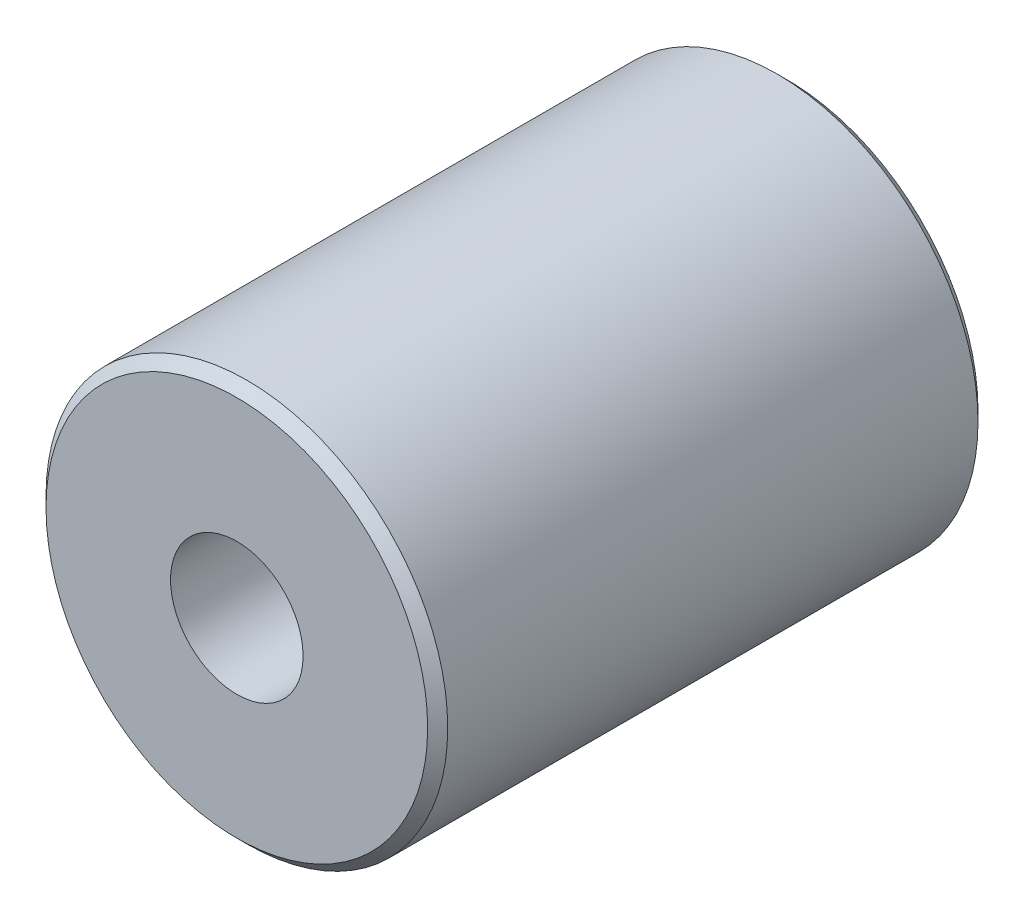
ISO-10303-21;
HEADER;
FILE_DESCRIPTION(('STEP AP214'),'2;1');
FILE_NAME('part.step','',(''),(''),'','','');
FILE_SCHEMA(('AUTOMOTIVE_DESIGN { 1 0 10303 214 1 1 1 1 }'));
ENDSEC;
DATA;
#1=APPLICATION_CONTEXT('core data for automotive mechanical design processes');
#2=APPLICATION_PROTOCOL_DEFINITION('international standard','automotive_design',2000,#1);
#3=PRODUCT_CONTEXT('',#1,'mechanical');
#4=PRODUCT('Part','Part','',(#3));
#5=PRODUCT_RELATED_PRODUCT_CATEGORY('part','',(#4));
#6=PRODUCT_DEFINITION_FORMATION('','',#4);
#7=PRODUCT_DEFINITION_CONTEXT('part definition',#1,'design');
#8=PRODUCT_DEFINITION('design','',#6,#7);
#9=PRODUCT_DEFINITION_SHAPE('','',#8);
#10=(LENGTH_UNIT() NAMED_UNIT(*) SI_UNIT(.MILLI.,.METRE.));
#11=(NAMED_UNIT(*) PLANE_ANGLE_UNIT() SI_UNIT($,.RADIAN.));
#12=(NAMED_UNIT(*) SI_UNIT($,.STERADIAN.) SOLID_ANGLE_UNIT());
#13=UNCERTAINTY_MEASURE_WITH_UNIT(LENGTH_MEASURE(1.E-05),#10,'distance_accuracy_value','');
#14=(GEOMETRIC_REPRESENTATION_CONTEXT(3) GLOBAL_UNCERTAINTY_ASSIGNED_CONTEXT((#13)) GLOBAL_UNIT_ASSIGNED_CONTEXT((#10,
#11,#12)) REPRESENTATION_CONTEXT('',''));
#15=CARTESIAN_POINT('',(0.,0.,0.));
#16=DIRECTION('',(0.,0.,1.));
#17=DIRECTION('',(1.,0.,0.));
#18=AXIS2_PLACEMENT_3D('',#15,#16,#17);
#19=CARTESIAN_POINT('',(0.,0.,-13.7));
#20=DIRECTION('',(0.,0.,1.));
#21=DIRECTION('',(1.,0.,0.));
#22=AXIS2_PLACEMENT_3D('',#19,#20,#21);
#23=CYLINDRICAL_SURFACE('',#22,5.);
#24=CARTESIAN_POINT('',(0.,0.,-13.45));
#25=DIRECTION('',(0.,0.,1.));
#26=DIRECTION('',(1.,0.,0.));
#27=AXIS2_PLACEMENT_3D('',#24,#25,#26);
#28=CIRCLE('',#27,5.);
#29=CARTESIAN_POINT('',(5.,0.,-13.45));
#30=VERTEX_POINT('',#29);
#31=EDGE_CURVE('E43',#30,#30,#28,.T.);
#32=ORIENTED_EDGE('',*,*,#31,.T.);
#33=EDGE_LOOP('',(#32));
#34=FACE_BOUND('',#33,.T.);
#35=CARTESIAN_POINT('',(0.,0.,-0.249999999999999));
#36=DIRECTION('',(0.,0.,1.));
#37=DIRECTION('',(1.,0.,0.));
#38=AXIS2_PLACEMENT_3D('',#35,#36,#37);
#39=CIRCLE('',#38,5.);
#40=CARTESIAN_POINT('',(5.,0.,-0.249999999999999));
#41=VERTEX_POINT('',#40);
#42=EDGE_CURVE('E47',#41,#41,#39,.F.);
#43=ORIENTED_EDGE('',*,*,#42,.T.);
#44=EDGE_LOOP('',(#43));
#45=FACE_BOUND('',#44,.T.);
#46=ADVANCED_FACE('F32',(#34,#45),#23,.T.);
#47=CARTESIAN_POINT('',(0.,0.,-13.7));
#48=DIRECTION('',(0.,0.,1.));
#49=DIRECTION('',(1.,0.,0.));
#50=AXIS2_PLACEMENT_3D('',#47,#48,#49);
#51=PLANE('',#50);
#52=CARTESIAN_POINT('',(0.,0.,-13.7));
#53=DIRECTION('',(0.,0.,1.));
#54=DIRECTION('',(1.,0.,0.));
#55=AXIS2_PLACEMENT_3D('',#52,#53,#54);
#56=CIRCLE('',#55,4.74999999999999);
#57=CARTESIAN_POINT('',(4.74999999999999,0.,-13.7));
#58=VERTEX_POINT('',#57);
#59=EDGE_CURVE('E39',#58,#58,#56,.F.);
#60=ORIENTED_EDGE('',*,*,#59,.T.);
#61=EDGE_LOOP('',(#60));
#62=FACE_BOUND('',#61,.T.);
#63=CARTESIAN_POINT('',(0.,0.,-13.7));
#64=DIRECTION('',(0.,0.,-1.));
#65=DIRECTION('',(-1.,0.,0.));
#66=AXIS2_PLACEMENT_3D('',#63,#64,#65);
#67=CIRCLE('',#66,1.64999999999999);
#68=CARTESIAN_POINT('',(-1.64999999999999,0.,-13.7));
#69=VERTEX_POINT('',#68);
#70=EDGE_CURVE('E55',#69,#69,#67,.T.);
#71=ORIENTED_EDGE('',*,*,#70,.F.);
#72=EDGE_LOOP('',(#71));
#73=FACE_BOUND('',#72,.T.);
#74=ADVANCED_FACE('F61',(#62,#73),#51,.F.);
#75=CARTESIAN_POINT('',(0.,0.,0.));
#76=DIRECTION('',(0.,0.,1.));
#77=DIRECTION('',(1.,0.,0.));
#78=AXIS2_PLACEMENT_3D('',#75,#76,#77);
#79=PLANE('',#78);
#80=CARTESIAN_POINT('',(0.,0.,0.));
#81=DIRECTION('',(0.,0.,1.));
#82=DIRECTION('',(1.,0.,0.));
#83=AXIS2_PLACEMENT_3D('',#80,#81,#82);
#84=CIRCLE('',#83,4.75000000000001);
#85=CARTESIAN_POINT('',(4.75000000000001,0.,0.));
#86=VERTEX_POINT('',#85);
#87=EDGE_CURVE('E10',#86,#86,#84,.T.);
#88=ORIENTED_EDGE('',*,*,#87,.T.);
#89=EDGE_LOOP('',(#88));
#90=FACE_BOUND('',#89,.T.);
#91=CARTESIAN_POINT('',(0.,0.,0.));
#92=DIRECTION('',(0.,0.,1.));
#93=DIRECTION('',(1.,0.,0.));
#94=AXIS2_PLACEMENT_3D('',#91,#92,#93);
#95=CIRCLE('',#94,1.65);
#96=CARTESIAN_POINT('',(1.65,0.,0.));
#97=VERTEX_POINT('',#96);
#98=EDGE_CURVE('E52',#97,#97,#95,.T.);
#99=ORIENTED_EDGE('',*,*,#98,.F.);
#100=EDGE_LOOP('',(#99));
#101=FACE_BOUND('',#100,.T.);
#102=ADVANCED_FACE('F63',(#90,#101),#79,.T.);
#103=CARTESIAN_POINT('',(0.,0.,0.));
#104=DIRECTION('',(0.,0.,1.));
#105=DIRECTION('',(1.,0.,0.));
#106=AXIS2_PLACEMENT_3D('',#103,#104,#105);
#107=CYLINDRICAL_SURFACE('',#106,1.65);
#108=ORIENTED_EDGE('',*,*,#98,.T.);
#109=EDGE_LOOP('',(#108));
#110=FACE_BOUND('',#109,.T.);
#111=ORIENTED_EDGE('',*,*,#70,.T.);
#112=EDGE_LOOP('',(#111));
#113=FACE_BOUND('',#112,.T.);
#114=ADVANCED_FACE('F59',(#110,#113),#107,.F.);
#115=CARTESIAN_POINT('',(0.,0.,-13.45));
#116=DIRECTION('',(0.,0.,1.));
#117=DIRECTION('',(1.,0.,0.));
#118=AXIS2_PLACEMENT_3D('',#115,#116,#117);
#119=CONICAL_SURFACE('',#118,5.,0.785398163397455);
#120=ORIENTED_EDGE('',*,*,#59,.F.);
#121=EDGE_LOOP('',(#120));
#122=FACE_BOUND('',#121,.T.);
#123=ORIENTED_EDGE('',*,*,#31,.F.);
#124=EDGE_LOOP('',(#123));
#125=FACE_BOUND('',#124,.T.);
#126=ADVANCED_FACE('F73',(#122,#125),#119,.T.);
#127=CARTESIAN_POINT('',(0.,0.,0.));
#128=DIRECTION('',(0.,0.,-1.));
#129=DIRECTION('',(-1.,0.,0.));
#130=AXIS2_PLACEMENT_3D('',#127,#128,#129);
#131=CONICAL_SURFACE('',#130,4.75000000000001,0.785398163397441);
#132=ORIENTED_EDGE('',*,*,#42,.F.);
#133=EDGE_LOOP('',(#132));
#134=FACE_BOUND('',#133,.T.);
#135=ORIENTED_EDGE('',*,*,#87,.F.);
#136=EDGE_LOOP('',(#135));
#137=FACE_BOUND('',#136,.T.);
#138=ADVANCED_FACE('F34',(#134,#137),#131,.T.);
#139=CLOSED_SHELL('',(#46,#74,#102,#114,#126,#138));
#140=MANIFOLD_SOLID_BREP('B2',#139);
#141=ADVANCED_BREP_SHAPE_REPRESENTATION('',(#18,#140),#14);
#142=SHAPE_DEFINITION_REPRESENTATION(#9,#141);
ENDSEC;
END-ISO-10303-21;
